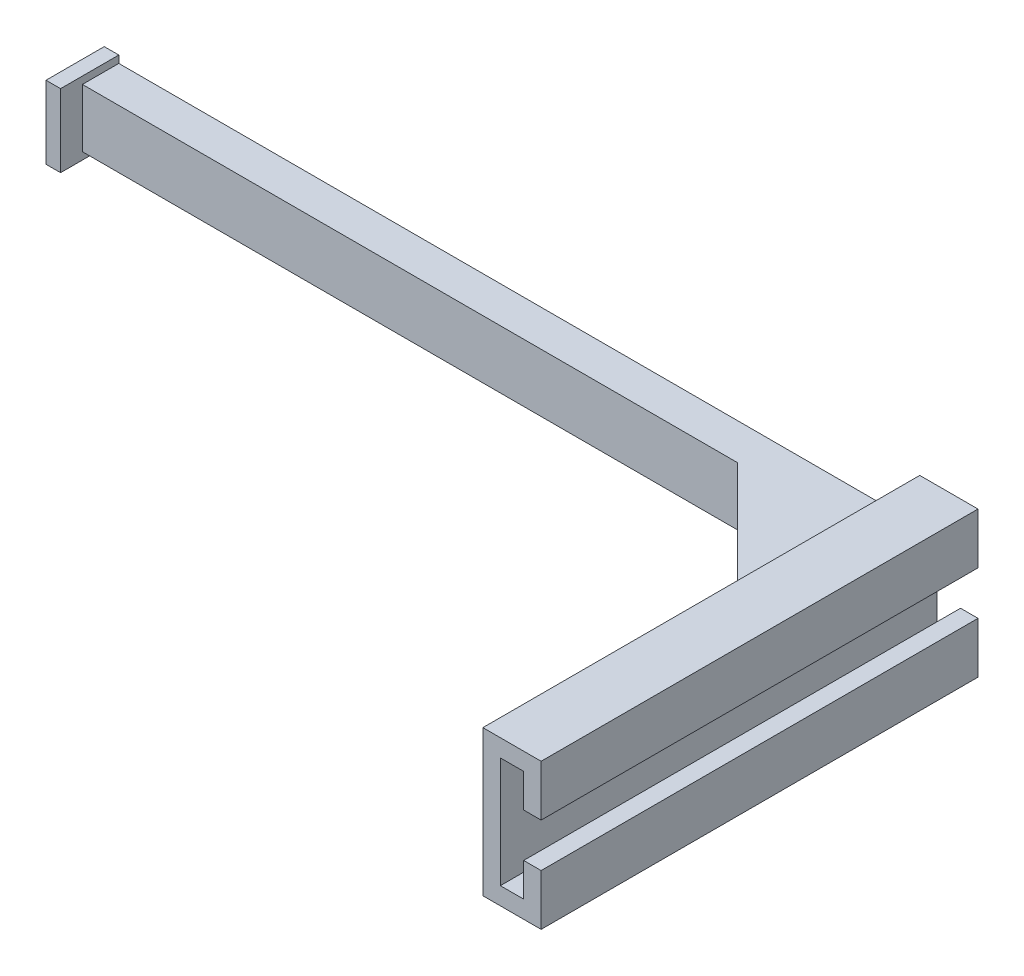
ISO-10303-21;
HEADER;
FILE_DESCRIPTION(('STEP AP214'),'2;1');
FILE_NAME('part.step','',(''),(''),'','','');
FILE_SCHEMA(('AUTOMOTIVE_DESIGN { 1 0 10303 214 1 1 1 1 }'));
ENDSEC;
DATA;
#1=APPLICATION_CONTEXT('core data for automotive mechanical design processes');
#2=APPLICATION_PROTOCOL_DEFINITION('international standard','automotive_design',2000,#1);
#3=PRODUCT_CONTEXT('',#1,'mechanical');
#4=PRODUCT('Part','Part','',(#3));
#5=PRODUCT_RELATED_PRODUCT_CATEGORY('part','',(#4));
#6=PRODUCT_DEFINITION_FORMATION('','',#4);
#7=PRODUCT_DEFINITION_CONTEXT('part definition',#1,'design');
#8=PRODUCT_DEFINITION('design','',#6,#7);
#9=PRODUCT_DEFINITION_SHAPE('','',#8);
#10=(LENGTH_UNIT() NAMED_UNIT(*) SI_UNIT(.MILLI.,.METRE.));
#11=(NAMED_UNIT(*) PLANE_ANGLE_UNIT() SI_UNIT($,.RADIAN.));
#12=(NAMED_UNIT(*) SI_UNIT($,.STERADIAN.) SOLID_ANGLE_UNIT());
#13=UNCERTAINTY_MEASURE_WITH_UNIT(LENGTH_MEASURE(1.E-05),#10,'distance_accuracy_value','');
#14=(GEOMETRIC_REPRESENTATION_CONTEXT(3) GLOBAL_UNCERTAINTY_ASSIGNED_CONTEXT((#13)) GLOBAL_UNIT_ASSIGNED_CONTEXT((#10,
#11,#12)) REPRESENTATION_CONTEXT('',''));
#15=CARTESIAN_POINT('',(0.,0.,0.));
#16=DIRECTION('',(0.,0.,1.));
#17=DIRECTION('',(1.,0.,0.));
#18=AXIS2_PLACEMENT_3D('',#15,#16,#17);
#19=CARTESIAN_POINT('',(-199.4,11.6,0.));
#20=DIRECTION('',(0.,1.,0.));
#21=DIRECTION('',(0.,0.,1.));
#22=AXIS2_PLACEMENT_3D('',#19,#20,#21);
#23=PLANE('',#22);
#24=DIRECTION('',(1.,0.,0.));
#25=VECTOR('',#24,1.);
#26=CARTESIAN_POINT('',(-199.4,11.6,0.));
#27=LINE('',#26,#25);
#28=CARTESIAN_POINT('',(-112.4,11.6,0.));
#29=VERTEX_POINT('',#28);
#30=CARTESIAN_POINT('',(-4.40000000000001,11.6,0.));
#31=VERTEX_POINT('',#30);
#32=EDGE_CURVE('E65',#29,#31,#27,.T.);
#33=ORIENTED_EDGE('',*,*,#32,.F.);
#34=DIRECTION('',(0.,0.,1.));
#35=VECTOR('',#34,1.);
#36=CARTESIAN_POINT('',(-112.4,11.6,0.));
#37=LINE('',#36,#35);
#38=CARTESIAN_POINT('',(-112.4,11.6,4.99999999999989));
#39=VERTEX_POINT('',#38);
#40=EDGE_CURVE('E244',#29,#39,#37,.T.);
#41=ORIENTED_EDGE('',*,*,#40,.T.);
#42=DIRECTION('',(1.,0.,0.));
#43=VECTOR('',#42,1.);
#44=CARTESIAN_POINT('',(-199.4,11.6,4.99999999999989));
#45=LINE('',#44,#43);
#46=CARTESIAN_POINT('',(-22.3999999999999,11.6,4.99999999999989));
#47=VERTEX_POINT('',#46);
#48=EDGE_CURVE('E249',#39,#47,#45,.T.);
#49=ORIENTED_EDGE('',*,*,#48,.T.);
#50=DIRECTION('',(-0.707106781186544,0.,-0.707106781186551));
#51=VECTOR('',#50,1.);
#52=CARTESIAN_POINT('',(-2.39999999999999,11.6,25.0000000000001));
#53=LINE('',#52,#51);
#54=CARTESIAN_POINT('',(-4.40000000000001,11.6,23.0000000000001));
#55=VERTEX_POINT('',#54);
#56=EDGE_CURVE('E358',#47,#55,#53,.F.);
#57=ORIENTED_EDGE('',*,*,#56,.T.);
#58=DIRECTION('',(0.,0.,-1.));
#59=VECTOR('',#58,1.);
#60=CARTESIAN_POINT('',(-4.40000000000001,11.6,0.));
#61=LINE('',#60,#59);
#62=EDGE_CURVE('E368',#55,#31,#61,.T.);
#63=ORIENTED_EDGE('',*,*,#62,.T.);
#64=EDGE_LOOP('',(#33,#41,#49,#57,#63));
#65=FACE_BOUND('',#64,.T.);
#66=ADVANCED_FACE('F41',(#65),#23,.T.);
#67=CARTESIAN_POINT('',(-199.4,3.59999999999999,0.));
#68=DIRECTION('',(0.,1.,0.));
#69=DIRECTION('',(0.,0.,1.));
#70=AXIS2_PLACEMENT_3D('',#67,#68,#69);
#71=PLANE('',#70);
#72=DIRECTION('',(0.,0.,1.));
#73=VECTOR('',#72,1.);
#74=CARTESIAN_POINT('',(-112.4,3.59999999999999,0.));
#75=LINE('',#74,#73);
#76=CARTESIAN_POINT('',(-112.4,3.59999999999999,0.));
#77=VERTEX_POINT('',#76);
#78=CARTESIAN_POINT('',(-112.4,3.59999999999999,4.99999999999989));
#79=VERTEX_POINT('',#78);
#80=EDGE_CURVE('E239',#77,#79,#75,.T.);
#81=ORIENTED_EDGE('',*,*,#80,.F.);
#82=DIRECTION('',(1.,0.,0.));
#83=VECTOR('',#82,1.);
#84=CARTESIAN_POINT('',(-199.4,3.59999999999999,0.));
#85=LINE('',#84,#83);
#86=CARTESIAN_POINT('',(-4.40000000000001,3.59999999999999,0.));
#87=VERTEX_POINT('',#86);
#88=EDGE_CURVE('E204',#77,#87,#85,.T.);
#89=ORIENTED_EDGE('',*,*,#88,.T.);
#90=DIRECTION('',(0.,0.,1.));
#91=VECTOR('',#90,1.);
#92=CARTESIAN_POINT('',(-4.40000000000001,3.59999999999999,0.));
#93=LINE('',#92,#91);
#94=CARTESIAN_POINT('',(-4.39999999999999,3.59999999999999,23.0000000000001));
#95=VERTEX_POINT('',#94);
#96=EDGE_CURVE('E360',#87,#95,#93,.T.);
#97=ORIENTED_EDGE('',*,*,#96,.T.);
#98=DIRECTION('',(0.707106781186544,0.,0.707106781186551));
#99=VECTOR('',#98,1.);
#100=CARTESIAN_POINT('',(-113.399999999999,3.59999999999999,-86.0000000000001));
#101=LINE('',#100,#99);
#102=CARTESIAN_POINT('',(-22.3999999999999,3.59999999999999,4.99999999999989));
#103=VERTEX_POINT('',#102);
#104=EDGE_CURVE('E355',#95,#103,#101,.F.);
#105=ORIENTED_EDGE('',*,*,#104,.T.);
#106=DIRECTION('',(1.,0.,0.));
#107=VECTOR('',#106,1.);
#108=CARTESIAN_POINT('',(-199.4,3.59999999999999,4.99999999999989));
#109=LINE('',#108,#107);
#110=EDGE_CURVE('E253',#79,#103,#109,.T.);
#111=ORIENTED_EDGE('',*,*,#110,.F.);
#112=EDGE_LOOP('',(#81,#89,#97,#105,#111));
#113=FACE_BOUND('',#112,.T.);
#114=ADVANCED_FACE('F392',(#113),#71,.F.);
#115=CARTESIAN_POINT('',(-199.4,11.6,4.99999999999989));
#116=DIRECTION('',(0.,0.,1.));
#117=DIRECTION('',(0.,-1.,0.));
#118=AXIS2_PLACEMENT_3D('',#115,#116,#117);
#119=PLANE('',#118);
#120=ORIENTED_EDGE('',*,*,#48,.F.);
#121=DIRECTION('',(0.,-1.,0.));
#122=VECTOR('',#121,1.);
#123=CARTESIAN_POINT('',(-112.4,11.6,4.99999999999989));
#124=LINE('',#123,#122);
#125=EDGE_CURVE('E11',#39,#79,#124,.T.);
#126=ORIENTED_EDGE('',*,*,#125,.T.);
#127=ORIENTED_EDGE('',*,*,#110,.T.);
#128=DIRECTION('',(0.,1.,0.));
#129=VECTOR('',#128,1.);
#130=CARTESIAN_POINT('',(-22.3999999999999,11.6,4.99999999999989));
#131=LINE('',#130,#129);
#132=EDGE_CURVE('E352',#103,#47,#131,.T.);
#133=ORIENTED_EDGE('',*,*,#132,.T.);
#134=EDGE_LOOP('',(#120,#126,#127,#133));
#135=FACE_BOUND('',#134,.T.);
#136=ADVANCED_FACE('F389',(#135),#119,.T.);
#137=CARTESIAN_POINT('',(-2.39999999999999,-2.40000000000001,60.0000000000001));
#138=DIRECTION('',(-1.,0.,0.));
#139=DIRECTION('',(0.,0.,1.));
#140=AXIS2_PLACEMENT_3D('',#137,#138,#139);
#141=PLANE('',#140);
#142=DIRECTION('',(0.,-1.,0.));
#143=VECTOR('',#142,1.);
#144=CARTESIAN_POINT('',(-2.39999999999999,3.59999999999999,25.0000000000001));
#145=LINE('',#144,#143);
#146=CARTESIAN_POINT('',(-2.39999999999999,13.6,25.0000000000001));
#147=VERTEX_POINT('',#146);
#148=CARTESIAN_POINT('',(-2.39999999999999,1.59999999999996,25.0000000000001));
#149=VERTEX_POINT('',#148);
#150=EDGE_CURVE('E350',#147,#149,#145,.T.);
#151=ORIENTED_EDGE('',*,*,#150,.T.);
#152=DIRECTION('',(0.,0.,-1.));
#153=VECTOR('',#152,1.);
#154=CARTESIAN_POINT('',(-2.39999999999999,1.59999999999996,60.0000000000001));
#155=LINE('',#154,#153);
#156=CARTESIAN_POINT('',(-2.39999999999999,1.59999999999996,0.));
#157=VERTEX_POINT('',#156);
#158=EDGE_CURVE('E366',#149,#157,#155,.T.);
#159=ORIENTED_EDGE('',*,*,#158,.T.);
#160=DIRECTION('',(0.,1.,0.));
#161=VECTOR('',#160,1.);
#162=CARTESIAN_POINT('',(-2.39999999999999,-2.40000000000001,0.));
#163=LINE('',#162,#161);
#164=CARTESIAN_POINT('',(-2.39999999999999,-2.40000000000001,0.));
#165=VERTEX_POINT('',#164);
#166=EDGE_CURVE('E308',#165,#157,#163,.T.);
#167=ORIENTED_EDGE('',*,*,#166,.F.);
#168=DIRECTION('',(0.,0.,-1.));
#169=VECTOR('',#168,1.);
#170=CARTESIAN_POINT('',(-2.39999999999999,-2.40000000000001,60.0000000000001));
#171=LINE('',#170,#169);
#172=CARTESIAN_POINT('',(-2.39999999999999,-2.40000000000001,60.0000000000001));
#173=VERTEX_POINT('',#172);
#174=EDGE_CURVE('E334',#173,#165,#171,.T.);
#175=ORIENTED_EDGE('',*,*,#174,.F.);
#176=DIRECTION('',(0.,1.,0.));
#177=VECTOR('',#176,1.);
#178=CARTESIAN_POINT('',(-2.39999999999999,-2.40000000000001,60.0000000000001));
#179=LINE('',#178,#177);
#180=CARTESIAN_POINT('',(-2.39999999999999,17.6,60.0000000000001));
#181=VERTEX_POINT('',#180);
#182=EDGE_CURVE('E273',#173,#181,#179,.T.);
#183=ORIENTED_EDGE('',*,*,#182,.T.);
#184=DIRECTION('',(0.,0.,-1.));
#185=VECTOR('',#184,1.);
#186=CARTESIAN_POINT('',(-2.39999999999999,17.6,60.0000000000001));
#187=LINE('',#186,#185);
#188=CARTESIAN_POINT('',(-2.39999999999999,17.6,0.));
#189=VERTEX_POINT('',#188);
#190=EDGE_CURVE('E336',#181,#189,#187,.T.);
#191=ORIENTED_EDGE('',*,*,#190,.T.);
#192=CARTESIAN_POINT('',(-2.39999999999999,13.6,0.));
#193=VERTEX_POINT('',#192);
#194=EDGE_CURVE('E307',#193,#189,#163,.T.);
#195=ORIENTED_EDGE('',*,*,#194,.F.);
#196=DIRECTION('',(0.,0.,1.));
#197=VECTOR('',#196,1.);
#198=CARTESIAN_POINT('',(-2.39999999999999,13.6,25.0000000000001));
#199=LINE('',#198,#197);
#200=EDGE_CURVE('E363',#193,#147,#199,.T.);
#201=ORIENTED_EDGE('',*,*,#200,.T.);
#202=EDGE_LOOP('',(#151,#159,#167,#175,#183,#191,#195,#201));
#203=FACE_BOUND('',#202,.T.);
#204=ADVANCED_FACE('F381',(#203),#141,.T.);
#205=CARTESIAN_POINT('',(0.,0.,60.0000000000001));
#206=DIRECTION('',(-1.,0.,0.));
#207=DIRECTION('',(0.,0.,1.));
#208=AXIS2_PLACEMENT_3D('',#205,#206,#207);
#209=PLANE('',#208);
#210=DIRECTION('',(0.,1.,0.));
#211=VECTOR('',#210,1.);
#212=CARTESIAN_POINT('',(0.,0.,0.));
#213=LINE('',#212,#211);
#214=CARTESIAN_POINT('',(0.,0.,0.));
#215=VERTEX_POINT('',#214);
#216=CARTESIAN_POINT('',(0.,15.2,0.));
#217=VERTEX_POINT('',#216);
#218=EDGE_CURVE('E251',#215,#217,#213,.T.);
#219=ORIENTED_EDGE('',*,*,#218,.T.);
#220=DIRECTION('',(0.,0.,-1.));
#221=VECTOR('',#220,1.);
#222=CARTESIAN_POINT('',(0.,15.2,60.0000000000001));
#223=LINE('',#222,#221);
#224=CARTESIAN_POINT('',(0.,15.2,60.0000000000001));
#225=VERTEX_POINT('',#224);
#226=EDGE_CURVE('E347',#225,#217,#223,.T.);
#227=ORIENTED_EDGE('',*,*,#226,.F.);
#228=DIRECTION('',(0.,1.,0.));
#229=VECTOR('',#228,1.);
#230=CARTESIAN_POINT('',(0.,0.,60.0000000000001));
#231=LINE('',#230,#229);
#232=CARTESIAN_POINT('',(0.,0.,60.0000000000001));
#233=VERTEX_POINT('',#232);
#234=EDGE_CURVE('E256',#233,#225,#231,.T.);
#235=ORIENTED_EDGE('',*,*,#234,.F.);
#236=DIRECTION('',(0.,0.,-1.));
#237=VECTOR('',#236,1.);
#238=CARTESIAN_POINT('',(0.,0.,60.0000000000001));
#239=LINE('',#238,#237);
#240=EDGE_CURVE('E289',#233,#215,#239,.T.);
#241=ORIENTED_EDGE('',*,*,#240,.T.);
#242=EDGE_LOOP('',(#219,#227,#235,#241));
#243=FACE_BOUND('',#242,.T.);
#244=ADVANCED_FACE('F437',(#243),#209,.F.);
#245=CARTESIAN_POINT('',(0.,15.2,60.0000000000001));
#246=DIRECTION('',(0.,1.,0.));
#247=DIRECTION('',(0.,0.,1.));
#248=AXIS2_PLACEMENT_3D('',#245,#246,#247);
#249=PLANE('',#248);
#250=DIRECTION('',(1.,0.,0.));
#251=VECTOR('',#250,1.);
#252=CARTESIAN_POINT('',(0.,15.2,0.));
#253=LINE('',#252,#251);
#254=CARTESIAN_POINT('',(3.20000000000001,15.2,0.));
#255=VERTEX_POINT('',#254);
#256=EDGE_CURVE('E292',#217,#255,#253,.T.);
#257=ORIENTED_EDGE('',*,*,#256,.T.);
#258=DIRECTION('',(0.,0.,-1.));
#259=VECTOR('',#258,1.);
#260=CARTESIAN_POINT('',(3.20000000000001,15.2,60.0000000000001));
#261=LINE('',#260,#259);
#262=CARTESIAN_POINT('',(3.20000000000001,15.2,60.0000000000001));
#263=VERTEX_POINT('',#262);
#264=EDGE_CURVE('E345',#263,#255,#261,.T.);
#265=ORIENTED_EDGE('',*,*,#264,.F.);
#266=DIRECTION('',(1.,0.,0.));
#267=VECTOR('',#266,1.);
#268=CARTESIAN_POINT('',(0.,15.2,60.0000000000001));
#269=LINE('',#268,#267);
#270=EDGE_CURVE('E259',#225,#263,#269,.T.);
#271=ORIENTED_EDGE('',*,*,#270,.F.);
#272=ORIENTED_EDGE('',*,*,#226,.T.);
#273=EDGE_LOOP('',(#257,#265,#271,#272));
#274=FACE_BOUND('',#273,.T.);
#275=ADVANCED_FACE('F434',(#274),#249,.F.);
#276=CARTESIAN_POINT('',(3.20000000000001,10.6,60.0000000000001));
#277=DIRECTION('',(-1.,0.,0.));
#278=DIRECTION('',(0.,0.,1.));
#279=AXIS2_PLACEMENT_3D('',#276,#277,#278);
#280=PLANE('',#279);
#281=DIRECTION('',(0.,1.,0.));
#282=VECTOR('',#281,1.);
#283=CARTESIAN_POINT('',(3.20000000000001,10.6,0.));
#284=LINE('',#283,#282);
#285=CARTESIAN_POINT('',(3.20000000000001,10.6,0.));
#286=VERTEX_POINT('',#285);
#287=EDGE_CURVE('E295',#286,#255,#284,.T.);
#288=ORIENTED_EDGE('',*,*,#287,.F.);
#289=DIRECTION('',(0.,0.,-1.));
#290=VECTOR('',#289,1.);
#291=CARTESIAN_POINT('',(3.20000000000001,10.6,60.0000000000001));
#292=LINE('',#291,#290);
#293=CARTESIAN_POINT('',(3.20000000000001,10.6,60.0000000000001));
#294=VERTEX_POINT('',#293);
#295=EDGE_CURVE('E343',#294,#286,#292,.T.);
#296=ORIENTED_EDGE('',*,*,#295,.F.);
#297=DIRECTION('',(0.,1.,0.));
#298=VECTOR('',#297,1.);
#299=CARTESIAN_POINT('',(3.20000000000001,10.6,60.0000000000001));
#300=LINE('',#299,#298);
#301=EDGE_CURVE('E262',#294,#263,#300,.T.);
#302=ORIENTED_EDGE('',*,*,#301,.T.);
#303=ORIENTED_EDGE('',*,*,#264,.T.);
#304=EDGE_LOOP('',(#288,#296,#302,#303));
#305=FACE_BOUND('',#304,.T.);
#306=ADVANCED_FACE('F428',(#305),#280,.T.);
#307=CARTESIAN_POINT('',(5.59999999999999,10.6,60.0000000000001));
#308=DIRECTION('',(0.,-1.,0.));
#309=DIRECTION('',(0.,0.,-1.));
#310=AXIS2_PLACEMENT_3D('',#307,#308,#309);
#311=PLANE('',#310);
#312=DIRECTION('',(-1.,0.,0.));
#313=VECTOR('',#312,1.);
#314=CARTESIAN_POINT('',(5.59999999999999,10.6,0.));
#315=LINE('',#314,#313);
#316=CARTESIAN_POINT('',(5.59999999999999,10.6,0.));
#317=VERTEX_POINT('',#316);
#318=EDGE_CURVE('E298',#317,#286,#315,.T.);
#319=ORIENTED_EDGE('',*,*,#318,.F.);
#320=DIRECTION('',(0.,0.,-1.));
#321=VECTOR('',#320,1.);
#322=CARTESIAN_POINT('',(5.59999999999999,10.6,60.0000000000001));
#323=LINE('',#322,#321);
#324=CARTESIAN_POINT('',(5.59999999999999,10.6,60.0000000000001));
#325=VERTEX_POINT('',#324);
#326=EDGE_CURVE('E341',#325,#317,#323,.T.);
#327=ORIENTED_EDGE('',*,*,#326,.F.);
#328=DIRECTION('',(-1.,0.,0.));
#329=VECTOR('',#328,1.);
#330=CARTESIAN_POINT('',(5.59999999999999,10.6,60.0000000000001));
#331=LINE('',#330,#329);
#332=EDGE_CURVE('E265',#325,#294,#331,.T.);
#333=ORIENTED_EDGE('',*,*,#332,.T.);
#334=ORIENTED_EDGE('',*,*,#295,.T.);
#335=EDGE_LOOP('',(#319,#327,#333,#334));
#336=FACE_BOUND('',#335,.T.);
#337=ADVANCED_FACE('F424',(#336),#311,.T.);
#338=CARTESIAN_POINT('',(5.59999999999999,10.6,60.0000000000001));
#339=DIRECTION('',(-1.,0.,0.));
#340=DIRECTION('',(0.,-1.,0.));
#341=AXIS2_PLACEMENT_3D('',#338,#339,#340);
#342=PLANE('',#341);
#343=DIRECTION('',(0.,1.,0.));
#344=VECTOR('',#343,1.);
#345=CARTESIAN_POINT('',(5.59999999999999,10.6,0.));
#346=LINE('',#345,#344);
#347=CARTESIAN_POINT('',(5.59999999999999,17.6,0.));
#348=VERTEX_POINT('',#347);
#349=EDGE_CURVE('E301',#317,#348,#346,.T.);
#350=ORIENTED_EDGE('',*,*,#349,.T.);
#351=DIRECTION('',(0.,0.,-1.));
#352=VECTOR('',#351,1.);
#353=CARTESIAN_POINT('',(5.59999999999999,17.6,60.0000000000001));
#354=LINE('',#353,#352);
#355=CARTESIAN_POINT('',(5.59999999999999,17.6,60.0000000000001));
#356=VERTEX_POINT('',#355);
#357=EDGE_CURVE('E339',#356,#348,#354,.T.);
#358=ORIENTED_EDGE('',*,*,#357,.F.);
#359=DIRECTION('',(0.,1.,0.));
#360=VECTOR('',#359,1.);
#361=CARTESIAN_POINT('',(5.59999999999999,10.6,60.0000000000001));
#362=LINE('',#361,#360);
#363=EDGE_CURVE('E268',#325,#356,#362,.T.);
#364=ORIENTED_EDGE('',*,*,#363,.F.);
#365=ORIENTED_EDGE('',*,*,#326,.T.);
#366=EDGE_LOOP('',(#350,#358,#364,#365));
#367=FACE_BOUND('',#366,.T.);
#368=ADVANCED_FACE('F580',(#367),#342,.F.);
#369=CARTESIAN_POINT('',(-2.39999999999999,17.6,60.0000000000001));
#370=DIRECTION('',(0.,1.,0.));
#371=DIRECTION('',(0.,0.,1.));
#372=AXIS2_PLACEMENT_3D('',#369,#370,#371);
#373=PLANE('',#372);
#374=DIRECTION('',(1.,0.,0.));
#375=VECTOR('',#374,1.);
#376=CARTESIAN_POINT('',(-2.39999999999999,17.6,0.));
#377=LINE('',#376,#375);
#378=EDGE_CURVE('E304',#189,#348,#377,.T.);
#379=ORIENTED_EDGE('',*,*,#378,.F.);
#380=ORIENTED_EDGE('',*,*,#190,.F.);
#381=DIRECTION('',(1.,0.,0.));
#382=VECTOR('',#381,1.);
#383=CARTESIAN_POINT('',(-2.39999999999999,17.6,60.0000000000001));
#384=LINE('',#383,#382);
#385=EDGE_CURVE('E270',#181,#356,#384,.T.);
#386=ORIENTED_EDGE('',*,*,#385,.T.);
#387=ORIENTED_EDGE('',*,*,#357,.T.);
#388=EDGE_LOOP('',(#379,#380,#386,#387));
#389=FACE_BOUND('',#388,.T.);
#390=ADVANCED_FACE('F419',(#389),#373,.T.);
#391=CARTESIAN_POINT('',(-2.39999999999999,-2.40000000000001,60.0000000000001));
#392=DIRECTION('',(0.,1.,0.));
#393=DIRECTION('',(-1.,0.,0.));
#394=AXIS2_PLACEMENT_3D('',#391,#392,#393);
#395=PLANE('',#394);
#396=DIRECTION('',(1.,0.,0.));
#397=VECTOR('',#396,1.);
#398=CARTESIAN_POINT('',(-2.39999999999999,-2.40000000000001,0.));
#399=LINE('',#398,#397);
#400=CARTESIAN_POINT('',(5.59999999999999,-2.40000000000001,0.));
#401=VERTEX_POINT('',#400);
#402=EDGE_CURVE('E311',#165,#401,#399,.T.);
#403=ORIENTED_EDGE('',*,*,#402,.T.);
#404=DIRECTION('',(0.,0.,-1.));
#405=VECTOR('',#404,1.);
#406=CARTESIAN_POINT('',(5.59999999999999,-2.40000000000001,60.0000000000001));
#407=LINE('',#406,#405);
#408=CARTESIAN_POINT('',(5.59999999999999,-2.40000000000001,60.0000000000001));
#409=VERTEX_POINT('',#408);
#410=EDGE_CURVE('E331',#409,#401,#407,.T.);
#411=ORIENTED_EDGE('',*,*,#410,.F.);
#412=DIRECTION('',(1.,0.,0.));
#413=VECTOR('',#412,1.);
#414=CARTESIAN_POINT('',(-2.39999999999999,-2.40000000000001,60.0000000000001));
#415=LINE('',#414,#413);
#416=EDGE_CURVE('E276',#173,#409,#415,.T.);
#417=ORIENTED_EDGE('',*,*,#416,.F.);
#418=ORIENTED_EDGE('',*,*,#174,.T.);
#419=EDGE_LOOP('',(#403,#411,#417,#418));
#420=FACE_BOUND('',#419,.T.);
#421=ADVANCED_FACE('F403',(#420),#395,.F.);
#422=CARTESIAN_POINT('',(5.59999999999999,-2.40000000000001,60.0000000000001));
#423=DIRECTION('',(-1.,0.,0.));
#424=DIRECTION('',(0.,-1.,0.));
#425=AXIS2_PLACEMENT_3D('',#422,#423,#424);
#426=PLANE('',#425);
#427=DIRECTION('',(0.,1.,0.));
#428=VECTOR('',#427,1.);
#429=CARTESIAN_POINT('',(5.59999999999999,-2.40000000000001,0.));
#430=LINE('',#429,#428);
#431=CARTESIAN_POINT('',(5.59999999999999,4.59999999999999,0.));
#432=VERTEX_POINT('',#431);
#433=EDGE_CURVE('E313',#401,#432,#430,.T.);
#434=ORIENTED_EDGE('',*,*,#433,.T.);
#435=DIRECTION('',(0.,0.,-1.));
#436=VECTOR('',#435,1.);
#437=CARTESIAN_POINT('',(5.59999999999999,4.59999999999999,60.0000000000001));
#438=LINE('',#437,#436);
#439=CARTESIAN_POINT('',(5.59999999999999,4.59999999999999,60.0000000000001));
#440=VERTEX_POINT('',#439);
#441=EDGE_CURVE('E329',#440,#432,#438,.T.);
#442=ORIENTED_EDGE('',*,*,#441,.F.);
#443=DIRECTION('',(0.,1.,0.));
#444=VECTOR('',#443,1.);
#445=CARTESIAN_POINT('',(5.59999999999999,-2.40000000000001,60.0000000000001));
#446=LINE('',#445,#444);
#447=EDGE_CURVE('E278',#409,#440,#446,.T.);
#448=ORIENTED_EDGE('',*,*,#447,.F.);
#449=ORIENTED_EDGE('',*,*,#410,.T.);
#450=EDGE_LOOP('',(#434,#442,#448,#449));
#451=FACE_BOUND('',#450,.T.);
#452=ADVANCED_FACE('F407',(#451),#426,.F.);
#453=CARTESIAN_POINT('',(3.20000000000001,4.59999999999999,60.0000000000001));
#454=DIRECTION('',(0.,1.,0.));
#455=DIRECTION('',(0.,0.,1.));
#456=AXIS2_PLACEMENT_3D('',#453,#454,#455);
#457=PLANE('',#456);
#458=DIRECTION('',(1.,0.,0.));
#459=VECTOR('',#458,1.);
#460=CARTESIAN_POINT('',(3.20000000000001,4.59999999999999,0.));
#461=LINE('',#460,#459);
#462=CARTESIAN_POINT('',(3.20000000000001,4.59999999999999,0.));
#463=VERTEX_POINT('',#462);
#464=EDGE_CURVE('E316',#463,#432,#461,.T.);
#465=ORIENTED_EDGE('',*,*,#464,.F.);
#466=DIRECTION('',(0.,0.,-1.));
#467=VECTOR('',#466,1.);
#468=CARTESIAN_POINT('',(3.20000000000001,4.59999999999999,60.0000000000001));
#469=LINE('',#468,#467);
#470=CARTESIAN_POINT('',(3.20000000000001,4.59999999999999,60.0000000000001));
#471=VERTEX_POINT('',#470);
#472=EDGE_CURVE('E327',#471,#463,#469,.T.);
#473=ORIENTED_EDGE('',*,*,#472,.F.);
#474=DIRECTION('',(1.,0.,0.));
#475=VECTOR('',#474,1.);
#476=CARTESIAN_POINT('',(3.20000000000001,4.59999999999999,60.0000000000001));
#477=LINE('',#476,#475);
#478=EDGE_CURVE('E280',#471,#440,#477,.T.);
#479=ORIENTED_EDGE('',*,*,#478,.T.);
#480=ORIENTED_EDGE('',*,*,#441,.T.);
#481=EDGE_LOOP('',(#465,#473,#479,#480));
#482=FACE_BOUND('',#481,.T.);
#483=ADVANCED_FACE('F446',(#482),#457,.T.);
#484=CARTESIAN_POINT('',(3.20000000000001,0.,60.0000000000001));
#485=DIRECTION('',(-1.,0.,0.));
#486=DIRECTION('',(0.,0.,1.));
#487=AXIS2_PLACEMENT_3D('',#484,#485,#486);
#488=PLANE('',#487);
#489=DIRECTION('',(0.,1.,0.));
#490=VECTOR('',#489,1.);
#491=CARTESIAN_POINT('',(3.20000000000001,0.,0.));
#492=LINE('',#491,#490);
#493=CARTESIAN_POINT('',(3.20000000000001,0.,0.));
#494=VERTEX_POINT('',#493);
#495=EDGE_CURVE('E319',#494,#463,#492,.T.);
#496=ORIENTED_EDGE('',*,*,#495,.F.);
#497=DIRECTION('',(0.,0.,-1.));
#498=VECTOR('',#497,1.);
#499=CARTESIAN_POINT('',(3.20000000000001,0.,60.0000000000001));
#500=LINE('',#499,#498);
#501=CARTESIAN_POINT('',(3.20000000000001,0.,60.0000000000001));
#502=VERTEX_POINT('',#501);
#503=EDGE_CURVE('E325',#502,#494,#500,.T.);
#504=ORIENTED_EDGE('',*,*,#503,.F.);
#505=DIRECTION('',(0.,1.,0.));
#506=VECTOR('',#505,1.);
#507=CARTESIAN_POINT('',(3.20000000000001,0.,60.0000000000001));
#508=LINE('',#507,#506);
#509=EDGE_CURVE('E283',#502,#471,#508,.T.);
#510=ORIENTED_EDGE('',*,*,#509,.T.);
#511=ORIENTED_EDGE('',*,*,#472,.T.);
#512=EDGE_LOOP('',(#496,#504,#510,#511));
#513=FACE_BOUND('',#512,.T.);
#514=ADVANCED_FACE('F444',(#513),#488,.T.);
#515=CARTESIAN_POINT('',(0.,0.,60.0000000000001));
#516=DIRECTION('',(0.,1.,0.));
#517=DIRECTION('',(0.,0.,1.));
#518=AXIS2_PLACEMENT_3D('',#515,#516,#517);
#519=PLANE('',#518);
#520=DIRECTION('',(1.,0.,0.));
#521=VECTOR('',#520,1.);
#522=CARTESIAN_POINT('',(0.,0.,0.));
#523=LINE('',#522,#521);
#524=EDGE_CURVE('E260',#215,#494,#523,.T.);
#525=ORIENTED_EDGE('',*,*,#524,.F.);
#526=ORIENTED_EDGE('',*,*,#240,.F.);
#527=DIRECTION('',(1.,0.,0.));
#528=VECTOR('',#527,1.);
#529=CARTESIAN_POINT('',(0.,0.,60.0000000000001));
#530=LINE('',#529,#528);
#531=EDGE_CURVE('E286',#233,#502,#530,.T.);
#532=ORIENTED_EDGE('',*,*,#531,.T.);
#533=ORIENTED_EDGE('',*,*,#503,.T.);
#534=EDGE_LOOP('',(#525,#526,#532,#533));
#535=FACE_BOUND('',#534,.T.);
#536=ADVANCED_FACE('F440',(#535),#519,.T.);
#537=CARTESIAN_POINT('',(0.,0.,60.0000000000001));
#538=DIRECTION('',(0.,0.,-1.));
#539=DIRECTION('',(-1.,0.,0.));
#540=AXIS2_PLACEMENT_3D('',#537,#538,#539);
#541=PLANE('',#540);
#542=ORIENTED_EDGE('',*,*,#234,.T.);
#543=ORIENTED_EDGE('',*,*,#270,.T.);
#544=ORIENTED_EDGE('',*,*,#301,.F.);
#545=ORIENTED_EDGE('',*,*,#332,.F.);
#546=ORIENTED_EDGE('',*,*,#363,.T.);
#547=ORIENTED_EDGE('',*,*,#385,.F.);
#548=ORIENTED_EDGE('',*,*,#182,.F.);
#549=ORIENTED_EDGE('',*,*,#416,.T.);
#550=ORIENTED_EDGE('',*,*,#447,.T.);
#551=ORIENTED_EDGE('',*,*,#478,.F.);
#552=ORIENTED_EDGE('',*,*,#509,.F.);
#553=ORIENTED_EDGE('',*,*,#531,.F.);
#554=EDGE_LOOP('',(#542,#543,#544,#545,#546,#547,#548,#549,#550,#551,#552,#553));
#555=FACE_BOUND('',#554,.T.);
#556=ADVANCED_FACE('F411',(#555),#541,.F.);
#557=CARTESIAN_POINT('',(0.,0.,0.));
#558=DIRECTION('',(0.,0.,-1.));
#559=DIRECTION('',(-1.,0.,0.));
#560=AXIS2_PLACEMENT_3D('',#557,#558,#559);
#561=PLANE('',#560);
#562=DIRECTION('',(0.,-1.,0.));
#563=VECTOR('',#562,1.);
#564=CARTESIAN_POINT('',(-112.4,12.6,0.));
#565=LINE('',#564,#563);
#566=CARTESIAN_POINT('',(-112.4,12.6,0.));
#567=VERTEX_POINT('',#566);
#568=EDGE_CURVE('E208',#567,#29,#565,.T.);
#569=ORIENTED_EDGE('',*,*,#568,.T.);
#570=ORIENTED_EDGE('',*,*,#32,.T.);
#571=DIRECTION('',(-0.707106781186545,-0.70710678118655,0.));
#572=VECTOR('',#571,1.);
#573=CARTESIAN_POINT('',(-2.39999999999999,13.6,0.));
#574=LINE('',#573,#572);
#575=EDGE_CURVE('E50',#31,#193,#574,.F.);
#576=ORIENTED_EDGE('',*,*,#575,.T.);
#577=ORIENTED_EDGE('',*,*,#194,.T.);
#578=ORIENTED_EDGE('',*,*,#378,.T.);
#579=ORIENTED_EDGE('',*,*,#349,.F.);
#580=ORIENTED_EDGE('',*,*,#318,.T.);
#581=ORIENTED_EDGE('',*,*,#287,.T.);
#582=ORIENTED_EDGE('',*,*,#256,.F.);
#583=ORIENTED_EDGE('',*,*,#218,.F.);
#584=ORIENTED_EDGE('',*,*,#524,.T.);
#585=ORIENTED_EDGE('',*,*,#495,.T.);
#586=ORIENTED_EDGE('',*,*,#464,.T.);
#587=ORIENTED_EDGE('',*,*,#433,.F.);
#588=ORIENTED_EDGE('',*,*,#402,.F.);
#589=ORIENTED_EDGE('',*,*,#166,.T.);
#590=DIRECTION('',(-0.707106781186545,0.70710678118655,0.));
#591=VECTOR('',#590,1.);
#592=CARTESIAN_POINT('',(-4.40000000000001,3.59999999999999,0.));
#593=LINE('',#592,#591);
#594=EDGE_CURVE('E373',#157,#87,#593,.T.);
#595=ORIENTED_EDGE('',*,*,#594,.T.);
#596=ORIENTED_EDGE('',*,*,#88,.F.);
#597=CARTESIAN_POINT('',(-112.4,2.59999999999999,0.));
#598=VERTEX_POINT('',#597);
#599=EDGE_CURVE('E198',#77,#598,#565,.T.);
#600=ORIENTED_EDGE('',*,*,#599,.T.);
#601=DIRECTION('',(-1.,0.,0.));
#602=VECTOR('',#601,1.);
#603=CARTESIAN_POINT('',(-112.4,2.59999999999999,0.));
#604=LINE('',#603,#602);
#605=CARTESIAN_POINT('',(-114.4,2.59999999999999,0.));
#606=VERTEX_POINT('',#605);
#607=EDGE_CURVE('E201',#598,#606,#604,.T.);
#608=ORIENTED_EDGE('',*,*,#607,.T.);
#609=DIRECTION('',(0.,-1.,0.));
#610=VECTOR('',#609,1.);
#611=CARTESIAN_POINT('',(-114.4,11.6,0.));
#612=LINE('',#611,#610);
#613=CARTESIAN_POINT('',(-114.4,12.6,0.));
#614=VERTEX_POINT('',#613);
#615=EDGE_CURVE('E247',#614,#606,#612,.T.);
#616=ORIENTED_EDGE('',*,*,#615,.F.);
#617=DIRECTION('',(-1.,0.,0.));
#618=VECTOR('',#617,1.);
#619=CARTESIAN_POINT('',(-112.4,12.6,0.));
#620=LINE('',#619,#618);
#621=EDGE_CURVE('E236',#567,#614,#620,.T.);
#622=ORIENTED_EDGE('',*,*,#621,.F.);
#623=EDGE_LOOP('',(#569,#570,#576,#577,#578,#579,#580,#581,#582,#583,#584,#585,#586,#587,#588,
#589,#595,#596,#600,#608,#616,#622));
#624=FACE_BOUND('',#623,.T.);
#625=ADVANCED_FACE('F200',(#624),#561,.T.);
#626=CARTESIAN_POINT('',(-2.39999999999999,-2.40000000000001,25.0000000000001));
#627=DIRECTION('',(-0.707106781186551,0.,0.707106781186544));
#628=DIRECTION('',(0.,1.,0.));
#629=AXIS2_PLACEMENT_3D('',#626,#627,#628);
#630=PLANE('',#629);
#631=ORIENTED_EDGE('',*,*,#56,.F.);
#632=ORIENTED_EDGE('',*,*,#132,.F.);
#633=ORIENTED_EDGE('',*,*,#104,.F.);
#634=DIRECTION('',(-0.577350269189623,0.577350269189626,-0.577350269189629));
#635=VECTOR('',#634,1.);
#636=CARTESIAN_POINT('',(-1.06666666666669,0.266666666666637,26.3333333333335));
#637=LINE('',#636,#635);
#638=EDGE_CURVE('E370',#95,#149,#637,.F.);
#639=ORIENTED_EDGE('',*,*,#638,.T.);
#640=ORIENTED_EDGE('',*,*,#150,.F.);
#641=DIRECTION('',(-0.577350269189623,-0.577350269189626,-0.577350269189629));
#642=VECTOR('',#641,1.);
#643=CARTESIAN_POINT('',(-7.73333333333331,8.26666666666667,19.6666666666667));
#644=LINE('',#643,#642);
#645=EDGE_CURVE('E57',#147,#55,#644,.T.);
#646=ORIENTED_EDGE('',*,*,#645,.T.);
#647=EDGE_LOOP('',(#631,#632,#633,#639,#640,#646));
#648=FACE_BOUND('',#647,.T.);
#649=ADVANCED_FACE('F386',(#648),#630,.T.);
#650=CARTESIAN_POINT('',(-4.40000000000001,3.59999999999999,0.));
#651=DIRECTION('',(0.70710678118655,0.707106781186545,0.));
#652=DIRECTION('',(0.,0.,1.));
#653=AXIS2_PLACEMENT_3D('',#650,#651,#652);
#654=PLANE('',#653);
#655=ORIENTED_EDGE('',*,*,#594,.F.);
#656=ORIENTED_EDGE('',*,*,#158,.F.);
#657=ORIENTED_EDGE('',*,*,#638,.F.);
#658=ORIENTED_EDGE('',*,*,#96,.F.);
#659=EDGE_LOOP('',(#655,#656,#657,#658));
#660=FACE_BOUND('',#659,.T.);
#661=ADVANCED_FACE('F396',(#660),#654,.F.);
#662=CARTESIAN_POINT('',(-2.39999999999999,13.6,60.0000000000001));
#663=DIRECTION('',(-0.70710678118655,0.707106781186545,0.));
#664=DIRECTION('',(0.,0.,-1.));
#665=AXIS2_PLACEMENT_3D('',#662,#663,#664);
#666=PLANE('',#665);
#667=ORIENTED_EDGE('',*,*,#575,.F.);
#668=ORIENTED_EDGE('',*,*,#62,.F.);
#669=ORIENTED_EDGE('',*,*,#645,.F.);
#670=ORIENTED_EDGE('',*,*,#200,.F.);
#671=EDGE_LOOP('',(#667,#668,#669,#670));
#672=FACE_BOUND('',#671,.T.);
#673=ADVANCED_FACE('F44',(#672),#666,.T.);
#674=CARTESIAN_POINT('',(-114.4,11.6,10.));
#675=DIRECTION('',(1.,0.,0.));
#676=DIRECTION('',(0.,0.,-1.));
#677=AXIS2_PLACEMENT_3D('',#674,#675,#676);
#678=PLANE('',#677);
#679=DIRECTION('',(0.,0.,-1.));
#680=VECTOR('',#679,1.);
#681=CARTESIAN_POINT('',(-114.4,12.6,0.));
#682=LINE('',#681,#680);
#683=CARTESIAN_POINT('',(-114.4,12.6,8.00000000000001));
#684=VERTEX_POINT('',#683);
#685=EDGE_CURVE('E209',#684,#614,#682,.T.);
#686=ORIENTED_EDGE('',*,*,#685,.T.);
#687=ORIENTED_EDGE('',*,*,#615,.T.);
#688=DIRECTION('',(0.,0.,1.));
#689=VECTOR('',#688,1.);
#690=CARTESIAN_POINT('',(-114.4,2.59999999999999,0.));
#691=LINE('',#690,#689);
#692=CARTESIAN_POINT('',(-114.4,2.59999999999999,8.00000000000001));
#693=VERTEX_POINT('',#692);
#694=EDGE_CURVE('E216',#606,#693,#691,.T.);
#695=ORIENTED_EDGE('',*,*,#694,.T.);
#696=DIRECTION('',(0.,1.,0.));
#697=VECTOR('',#696,1.);
#698=CARTESIAN_POINT('',(-114.4,12.6,8.00000000000001));
#699=LINE('',#698,#697);
#700=EDGE_CURVE('E231',#693,#684,#699,.T.);
#701=ORIENTED_EDGE('',*,*,#700,.T.);
#702=EDGE_LOOP('',(#686,#687,#695,#701));
#703=FACE_BOUND('',#702,.T.);
#704=ADVANCED_FACE('F510',(#703),#678,.F.);
#705=CARTESIAN_POINT('',(-112.4,12.6,0.));
#706=DIRECTION('',(0.,1.,0.));
#707=DIRECTION('',(0.,0.,1.));
#708=AXIS2_PLACEMENT_3D('',#705,#706,#707);
#709=PLANE('',#708);
#710=ORIENTED_EDGE('',*,*,#685,.F.);
#711=DIRECTION('',(-1.,0.,0.));
#712=VECTOR('',#711,1.);
#713=CARTESIAN_POINT('',(-112.4,12.6,8.00000000000001));
#714=LINE('',#713,#712);
#715=CARTESIAN_POINT('',(-112.4,12.6,8.00000000000001));
#716=VERTEX_POINT('',#715);
#717=EDGE_CURVE('E240',#716,#684,#714,.T.);
#718=ORIENTED_EDGE('',*,*,#717,.F.);
#719=DIRECTION('',(0.,0.,-1.));
#720=VECTOR('',#719,1.);
#721=CARTESIAN_POINT('',(-112.4,12.6,0.));
#722=LINE('',#721,#720);
#723=EDGE_CURVE('E218',#716,#567,#722,.T.);
#724=ORIENTED_EDGE('',*,*,#723,.T.);
#725=ORIENTED_EDGE('',*,*,#621,.T.);
#726=EDGE_LOOP('',(#710,#718,#724,#725));
#727=FACE_BOUND('',#726,.T.);
#728=ADVANCED_FACE('F517',(#727),#709,.T.);
#729=CARTESIAN_POINT('',(-112.4,12.6,8.00000000000001));
#730=DIRECTION('',(0.,0.,1.));
#731=DIRECTION('',(0.,-1.,0.));
#732=AXIS2_PLACEMENT_3D('',#729,#730,#731);
#733=PLANE('',#732);
#734=ORIENTED_EDGE('',*,*,#700,.F.);
#735=DIRECTION('',(-1.,0.,0.));
#736=VECTOR('',#735,1.);
#737=CARTESIAN_POINT('',(-112.4,2.59999999999999,8.00000000000001));
#738=LINE('',#737,#736);
#739=CARTESIAN_POINT('',(-112.4,2.59999999999999,8.00000000000001));
#740=VERTEX_POINT('',#739);
#741=EDGE_CURVE('E217',#740,#693,#738,.T.);
#742=ORIENTED_EDGE('',*,*,#741,.F.);
#743=DIRECTION('',(0.,1.,0.));
#744=VECTOR('',#743,1.);
#745=CARTESIAN_POINT('',(-112.4,12.6,8.00000000000001));
#746=LINE('',#745,#744);
#747=EDGE_CURVE('E224',#740,#716,#746,.T.);
#748=ORIENTED_EDGE('',*,*,#747,.T.);
#749=ORIENTED_EDGE('',*,*,#717,.T.);
#750=EDGE_LOOP('',(#734,#742,#748,#749));
#751=FACE_BOUND('',#750,.T.);
#752=ADVANCED_FACE('F540',(#751),#733,.T.);
#753=CARTESIAN_POINT('',(-112.4,2.59999999999999,0.));
#754=DIRECTION('',(0.,-1.,0.));
#755=DIRECTION('',(0.,0.,-1.));
#756=AXIS2_PLACEMENT_3D('',#753,#754,#755);
#757=PLANE('',#756);
#758=ORIENTED_EDGE('',*,*,#694,.F.);
#759=ORIENTED_EDGE('',*,*,#607,.F.);
#760=DIRECTION('',(0.,0.,1.));
#761=VECTOR('',#760,1.);
#762=CARTESIAN_POINT('',(-112.4,2.59999999999999,0.));
#763=LINE('',#762,#761);
#764=EDGE_CURVE('E214',#598,#740,#763,.T.);
#765=ORIENTED_EDGE('',*,*,#764,.T.);
#766=ORIENTED_EDGE('',*,*,#741,.T.);
#767=EDGE_LOOP('',(#758,#759,#765,#766));
#768=FACE_BOUND('',#767,.T.);
#769=ADVANCED_FACE('F213',(#768),#757,.T.);
#770=CARTESIAN_POINT('',(-112.4,0.,0.));
#771=DIRECTION('',(-1.,0.,0.));
#772=DIRECTION('',(0.,0.,1.));
#773=AXIS2_PLACEMENT_3D('',#770,#771,#772);
#774=PLANE('',#773);
#775=ORIENTED_EDGE('',*,*,#40,.F.);
#776=ORIENTED_EDGE('',*,*,#568,.F.);
#777=ORIENTED_EDGE('',*,*,#723,.F.);
#778=ORIENTED_EDGE('',*,*,#747,.F.);
#779=ORIENTED_EDGE('',*,*,#764,.F.);
#780=ORIENTED_EDGE('',*,*,#599,.F.);
#781=ORIENTED_EDGE('',*,*,#80,.T.);
#782=ORIENTED_EDGE('',*,*,#125,.F.);
#783=EDGE_LOOP('',(#775,#776,#777,#778,#779,#780,#781,#782));
#784=FACE_BOUND('',#783,.T.);
#785=ADVANCED_FACE('F221',(#784),#774,.F.);
#786=CLOSED_SHELL('',(#66,#114,#136,#204,#244,#275,#306,#337,#368,#390,#421,#452,#483,#514,#536,
#556,#625,#649,#661,#673,#704,#728,#752,#769,#785));
#787=MANIFOLD_SOLID_BREP('B2',#786);
#788=ADVANCED_BREP_SHAPE_REPRESENTATION('',(#18,#787),#14);
#789=SHAPE_DEFINITION_REPRESENTATION(#9,#788);
ENDSEC;
END-ISO-10303-21;
